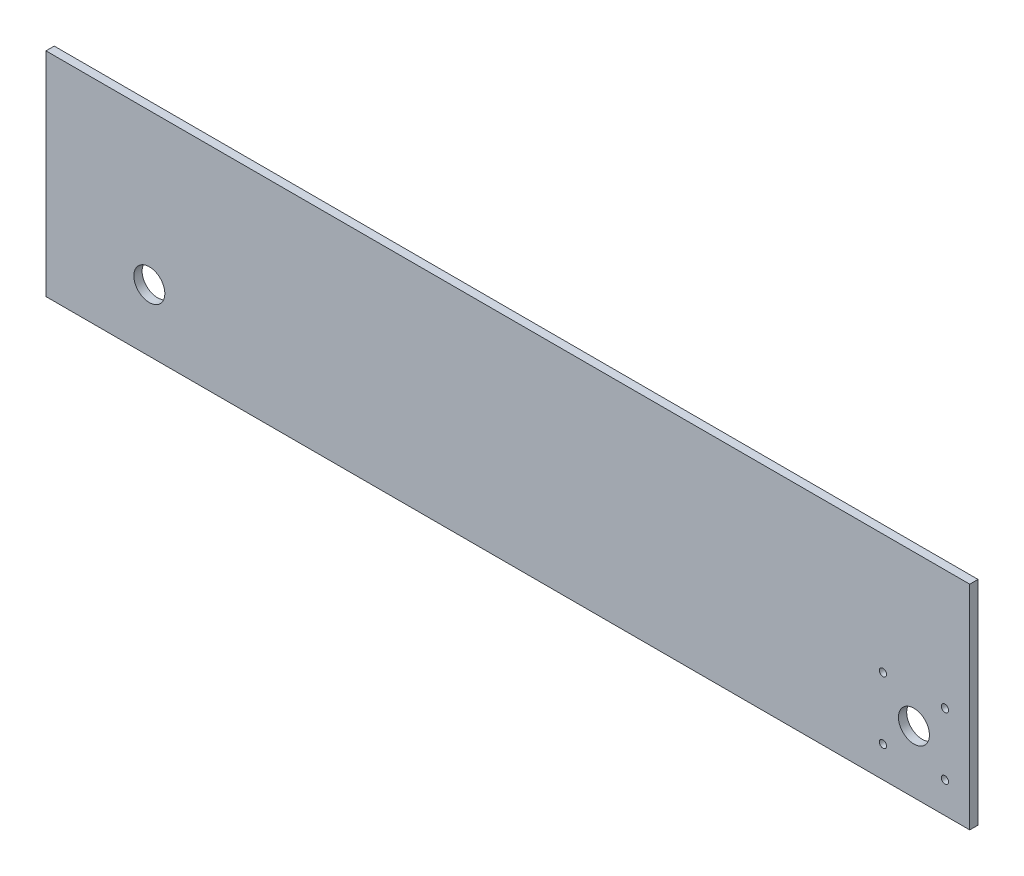
ISO-10303-21;
HEADER;
FILE_DESCRIPTION(('STEP AP214'),'2;1');
FILE_NAME('part.step','',(''),(''),'','','');
FILE_SCHEMA(('AUTOMOTIVE_DESIGN { 1 0 10303 214 1 1 1 1 }'));
ENDSEC;
DATA;
#1=APPLICATION_CONTEXT('core data for automotive mechanical design processes');
#2=APPLICATION_PROTOCOL_DEFINITION('international standard','automotive_design',2000,#1);
#3=PRODUCT_CONTEXT('',#1,'mechanical');
#4=PRODUCT('Part','Part','',(#3));
#5=PRODUCT_RELATED_PRODUCT_CATEGORY('part','',(#4));
#6=PRODUCT_DEFINITION_FORMATION('','',#4);
#7=PRODUCT_DEFINITION_CONTEXT('part definition',#1,'design');
#8=PRODUCT_DEFINITION('design','',#6,#7);
#9=PRODUCT_DEFINITION_SHAPE('','',#8);
#10=(LENGTH_UNIT() NAMED_UNIT(*) SI_UNIT(.MILLI.,.METRE.));
#11=(NAMED_UNIT(*) PLANE_ANGLE_UNIT() SI_UNIT($,.RADIAN.));
#12=(NAMED_UNIT(*) SI_UNIT($,.STERADIAN.) SOLID_ANGLE_UNIT());
#13=UNCERTAINTY_MEASURE_WITH_UNIT(LENGTH_MEASURE(1.E-05),#10,'distance_accuracy_value','');
#14=(GEOMETRIC_REPRESENTATION_CONTEXT(3) GLOBAL_UNCERTAINTY_ASSIGNED_CONTEXT((#13)) GLOBAL_UNIT_ASSIGNED_CONTEXT((#10,
#11,#12)) REPRESENTATION_CONTEXT('',''));
#15=CARTESIAN_POINT('',(0.,0.,0.));
#16=DIRECTION('',(0.,0.,1.));
#17=DIRECTION('',(1.,0.,0.));
#18=AXIS2_PLACEMENT_3D('',#15,#16,#17);
#19=CARTESIAN_POINT('',(0.,0.,4.));
#20=DIRECTION('',(1.,0.,0.));
#21=DIRECTION('',(0.,0.,-1.));
#22=AXIS2_PLACEMENT_3D('',#19,#20,#21);
#23=PLANE('',#22);
#24=DIRECTION('',(0.,-1.,0.));
#25=VECTOR('',#24,1.);
#26=CARTESIAN_POINT('',(0.,0.,0.));
#27=LINE('',#26,#25);
#28=CARTESIAN_POINT('',(0.,103.,0.));
#29=VERTEX_POINT('',#28);
#30=CARTESIAN_POINT('',(0.,0.,0.));
#31=VERTEX_POINT('',#30);
#32=EDGE_CURVE('E85',#29,#31,#27,.T.);
#33=ORIENTED_EDGE('',*,*,#32,.T.);
#34=DIRECTION('',(0.,0.,-1.));
#35=VECTOR('',#34,1.);
#36=CARTESIAN_POINT('',(0.,0.,4.));
#37=LINE('',#36,#35);
#38=CARTESIAN_POINT('',(0.,0.,4.));
#39=VERTEX_POINT('',#38);
#40=EDGE_CURVE('E11',#39,#31,#37,.T.);
#41=ORIENTED_EDGE('',*,*,#40,.F.);
#42=DIRECTION('',(0.,-1.,0.));
#43=VECTOR('',#42,1.);
#44=CARTESIAN_POINT('',(0.,0.,4.));
#45=LINE('',#44,#43);
#46=CARTESIAN_POINT('',(0.,103.,4.));
#47=VERTEX_POINT('',#46);
#48=EDGE_CURVE('E79',#47,#39,#45,.T.);
#49=ORIENTED_EDGE('',*,*,#48,.F.);
#50=DIRECTION('',(0.,0.,-1.));
#51=VECTOR('',#50,1.);
#52=CARTESIAN_POINT('',(0.,103.,4.));
#53=LINE('',#52,#51);
#54=EDGE_CURVE('E40',#47,#29,#53,.T.);
#55=ORIENTED_EDGE('',*,*,#54,.T.);
#56=EDGE_LOOP('',(#33,#41,#49,#55));
#57=FACE_BOUND('',#56,.T.);
#58=ADVANCED_FACE('F33',(#57),#23,.F.);
#59=CARTESIAN_POINT('',(0.,0.,4.));
#60=DIRECTION('',(0.,1.,0.));
#61=DIRECTION('',(0.,0.,1.));
#62=AXIS2_PLACEMENT_3D('',#59,#60,#61);
#63=PLANE('',#62);
#64=DIRECTION('',(1.,0.,0.));
#65=VECTOR('',#64,1.);
#66=CARTESIAN_POINT('',(0.,0.,0.));
#67=LINE('',#66,#65);
#68=CARTESIAN_POINT('',(447.,0.,0.));
#69=VERTEX_POINT('',#68);
#70=EDGE_CURVE('E80',#31,#69,#67,.T.);
#71=ORIENTED_EDGE('',*,*,#70,.T.);
#72=DIRECTION('',(0.,0.,-1.));
#73=VECTOR('',#72,1.);
#74=CARTESIAN_POINT('',(447.,0.,10.));
#75=LINE('',#74,#73);
#76=CARTESIAN_POINT('',(447.,0.,4.));
#77=VERTEX_POINT('',#76);
#78=EDGE_CURVE('E47',#77,#69,#75,.T.);
#79=ORIENTED_EDGE('',*,*,#78,.F.);
#80=DIRECTION('',(1.,0.,0.));
#81=VECTOR('',#80,1.);
#82=CARTESIAN_POINT('',(0.,0.,4.));
#83=LINE('',#82,#81);
#84=EDGE_CURVE('E97',#39,#77,#83,.T.);
#85=ORIENTED_EDGE('',*,*,#84,.F.);
#86=ORIENTED_EDGE('',*,*,#40,.T.);
#87=EDGE_LOOP('',(#71,#79,#85,#86));
#88=FACE_BOUND('',#87,.T.);
#89=ADVANCED_FACE('F142',(#88),#63,.F.);
#90=CARTESIAN_POINT('',(0.,103.,4.));
#91=DIRECTION('',(0.,-1.,0.));
#92=DIRECTION('',(0.,0.,-1.));
#93=AXIS2_PLACEMENT_3D('',#90,#91,#92);
#94=PLANE('',#93);
#95=DIRECTION('',(-1.,0.,0.));
#96=VECTOR('',#95,1.);
#97=CARTESIAN_POINT('',(0.,103.,4.));
#98=LINE('',#97,#96);
#99=CARTESIAN_POINT('',(447.,103.,4.));
#100=VERTEX_POINT('',#99);
#101=EDGE_CURVE('E56',#100,#47,#98,.T.);
#102=ORIENTED_EDGE('',*,*,#101,.F.);
#103=DIRECTION('',(0.,0.,-1.));
#104=VECTOR('',#103,1.);
#105=CARTESIAN_POINT('',(447.,103.,10.));
#106=LINE('',#105,#104);
#107=CARTESIAN_POINT('',(447.,103.,0.));
#108=VERTEX_POINT('',#107);
#109=EDGE_CURVE('E76',#100,#108,#106,.T.);
#110=ORIENTED_EDGE('',*,*,#109,.T.);
#111=DIRECTION('',(-1.,0.,0.));
#112=VECTOR('',#111,1.);
#113=CARTESIAN_POINT('',(0.,103.,0.));
#114=LINE('',#113,#112);
#115=EDGE_CURVE('E70',#108,#29,#114,.T.);
#116=ORIENTED_EDGE('',*,*,#115,.T.);
#117=ORIENTED_EDGE('',*,*,#54,.F.);
#118=EDGE_LOOP('',(#102,#110,#116,#117));
#119=FACE_BOUND('',#118,.T.);
#120=ADVANCED_FACE('F72',(#119),#94,.F.);
#121=CARTESIAN_POINT('',(0.,0.,4.));
#122=DIRECTION('',(0.,0.,-1.));
#123=DIRECTION('',(-1.,0.,0.));
#124=AXIS2_PLACEMENT_3D('',#121,#122,#123);
#125=PLANE('',#124);
#126=CARTESIAN_POINT('',(405.,45.,4.));
#127=DIRECTION('',(0.,0.,1.));
#128=DIRECTION('',(-1.,0.,0.));
#129=AXIS2_PLACEMENT_3D('',#126,#127,#128);
#130=CIRCLE('',#129,1.74999999999998);
#131=CARTESIAN_POINT('',(403.25,45.,4.));
#132=VERTEX_POINT('',#131);
#133=EDGE_CURVE('E129',#132,#132,#130,.T.);
#134=ORIENTED_EDGE('',*,*,#133,.F.);
#135=EDGE_LOOP('',(#134));
#136=FACE_BOUND('',#135,.T.);
#137=CARTESIAN_POINT('',(405.,15.,4.));
#138=DIRECTION('',(0.,0.,1.));
#139=DIRECTION('',(1.,0.,0.));
#140=AXIS2_PLACEMENT_3D('',#137,#138,#139);
#141=CIRCLE('',#140,1.74999999999998);
#142=CARTESIAN_POINT('',(406.75,15.,4.));
#143=VERTEX_POINT('',#142);
#144=EDGE_CURVE('E123',#143,#143,#141,.T.);
#145=ORIENTED_EDGE('',*,*,#144,.F.);
#146=EDGE_LOOP('',(#145));
#147=FACE_BOUND('',#146,.T.);
#148=CARTESIAN_POINT('',(435.,15.,4.));
#149=DIRECTION('',(0.,0.,1.));
#150=DIRECTION('',(-1.,0.,0.));
#151=AXIS2_PLACEMENT_3D('',#148,#149,#150);
#152=CIRCLE('',#151,1.74999999999998);
#153=CARTESIAN_POINT('',(433.25,15.,4.));
#154=VERTEX_POINT('',#153);
#155=EDGE_CURVE('E116',#154,#154,#152,.T.);
#156=ORIENTED_EDGE('',*,*,#155,.F.);
#157=EDGE_LOOP('',(#156));
#158=FACE_BOUND('',#157,.T.);
#159=CARTESIAN_POINT('',(435.,45.,4.));
#160=DIRECTION('',(0.,0.,1.));
#161=DIRECTION('',(1.,0.,0.));
#162=AXIS2_PLACEMENT_3D('',#159,#160,#161);
#163=CIRCLE('',#162,1.74999999999998);
#164=CARTESIAN_POINT('',(436.75,45.,4.));
#165=VERTEX_POINT('',#164);
#166=EDGE_CURVE('E110',#165,#165,#163,.T.);
#167=ORIENTED_EDGE('',*,*,#166,.F.);
#168=EDGE_LOOP('',(#167));
#169=FACE_BOUND('',#168,.T.);
#170=CARTESIAN_POINT('',(420.,30.,4.));
#171=DIRECTION('',(0.,0.,1.));
#172=DIRECTION('',(1.,0.,0.));
#173=AXIS2_PLACEMENT_3D('',#170,#171,#172);
#174=CIRCLE('',#173,7.50000000000001);
#175=CARTESIAN_POINT('',(427.5,30.,4.));
#176=VERTEX_POINT('',#175);
#177=EDGE_CURVE('E104',#176,#176,#174,.T.);
#178=ORIENTED_EDGE('',*,*,#177,.F.);
#179=EDGE_LOOP('',(#178));
#180=FACE_BOUND('',#179,.T.);
#181=CARTESIAN_POINT('',(50.,30.,4.));
#182=DIRECTION('',(0.,0.,1.));
#183=DIRECTION('',(1.,0.,0.));
#184=AXIS2_PLACEMENT_3D('',#181,#182,#183);
#185=CIRCLE('',#184,7.5);
#186=CARTESIAN_POINT('',(57.5,30.,4.));
#187=VERTEX_POINT('',#186);
#188=EDGE_CURVE('E93',#187,#187,#185,.T.);
#189=ORIENTED_EDGE('',*,*,#188,.F.);
#190=EDGE_LOOP('',(#189));
#191=FACE_BOUND('',#190,.T.);
#192=ORIENTED_EDGE('',*,*,#84,.T.);
#193=DIRECTION('',(0.,1.,0.));
#194=VECTOR('',#193,1.);
#195=CARTESIAN_POINT('',(447.,0.,4.));
#196=LINE('',#195,#194);
#197=EDGE_CURVE('E120',#77,#100,#196,.T.);
#198=ORIENTED_EDGE('',*,*,#197,.T.);
#199=ORIENTED_EDGE('',*,*,#101,.T.);
#200=ORIENTED_EDGE('',*,*,#48,.T.);
#201=EDGE_LOOP('',(#192,#198,#199,#200));
#202=FACE_BOUND('',#201,.T.);
#203=ADVANCED_FACE('F143',(#136,#147,#158,#169,#180,#191,#202),#125,.F.);
#204=CARTESIAN_POINT('',(0.,0.,0.));
#205=DIRECTION('',(0.,0.,-1.));
#206=DIRECTION('',(-1.,0.,0.));
#207=AXIS2_PLACEMENT_3D('',#204,#205,#206);
#208=PLANE('',#207);
#209=DIRECTION('',(0.,1.,0.));
#210=VECTOR('',#209,1.);
#211=CARTESIAN_POINT('',(447.,103.,0.));
#212=LINE('',#211,#210);
#213=EDGE_CURVE('E136',#69,#108,#212,.T.);
#214=ORIENTED_EDGE('',*,*,#213,.F.);
#215=ORIENTED_EDGE('',*,*,#70,.F.);
#216=ORIENTED_EDGE('',*,*,#32,.F.);
#217=ORIENTED_EDGE('',*,*,#115,.F.);
#218=EDGE_LOOP('',(#214,#215,#216,#217));
#219=FACE_BOUND('',#218,.T.);
#220=CARTESIAN_POINT('',(405.,45.,0.));
#221=DIRECTION('',(0.,0.,1.));
#222=DIRECTION('',(-1.,0.,0.));
#223=AXIS2_PLACEMENT_3D('',#220,#221,#222);
#224=CIRCLE('',#223,1.74999999999998);
#225=CARTESIAN_POINT('',(403.25,45.,0.));
#226=VERTEX_POINT('',#225);
#227=EDGE_CURVE('E113',#226,#226,#224,.T.);
#228=ORIENTED_EDGE('',*,*,#227,.T.);
#229=EDGE_LOOP('',(#228));
#230=FACE_BOUND('',#229,.T.);
#231=CARTESIAN_POINT('',(405.,15.,0.));
#232=DIRECTION('',(0.,0.,1.));
#233=DIRECTION('',(1.,0.,0.));
#234=AXIS2_PLACEMENT_3D('',#231,#232,#233);
#235=CIRCLE('',#234,1.74999999999998);
#236=CARTESIAN_POINT('',(406.75,15.,0.));
#237=VERTEX_POINT('',#236);
#238=EDGE_CURVE('E126',#237,#237,#235,.T.);
#239=ORIENTED_EDGE('',*,*,#238,.T.);
#240=EDGE_LOOP('',(#239));
#241=FACE_BOUND('',#240,.T.);
#242=CARTESIAN_POINT('',(435.,15.,0.));
#243=DIRECTION('',(0.,0.,1.));
#244=DIRECTION('',(-1.,0.,0.));
#245=AXIS2_PLACEMENT_3D('',#242,#243,#244);
#246=CIRCLE('',#245,1.74999999999998);
#247=CARTESIAN_POINT('',(433.25,15.,0.));
#248=VERTEX_POINT('',#247);
#249=EDGE_CURVE('E119',#248,#248,#246,.T.);
#250=ORIENTED_EDGE('',*,*,#249,.T.);
#251=EDGE_LOOP('',(#250));
#252=FACE_BOUND('',#251,.T.);
#253=CARTESIAN_POINT('',(435.,45.,0.));
#254=DIRECTION('',(0.,0.,1.));
#255=DIRECTION('',(1.,0.,0.));
#256=AXIS2_PLACEMENT_3D('',#253,#254,#255);
#257=CIRCLE('',#256,1.74999999999998);
#258=CARTESIAN_POINT('',(436.75,45.,0.));
#259=VERTEX_POINT('',#258);
#260=EDGE_CURVE('E107',#259,#259,#257,.T.);
#261=ORIENTED_EDGE('',*,*,#260,.T.);
#262=EDGE_LOOP('',(#261));
#263=FACE_BOUND('',#262,.T.);
#264=CARTESIAN_POINT('',(420.,30.,0.));
#265=DIRECTION('',(0.,0.,1.));
#266=DIRECTION('',(1.,0.,0.));
#267=AXIS2_PLACEMENT_3D('',#264,#265,#266);
#268=CIRCLE('',#267,7.50000000000001);
#269=CARTESIAN_POINT('',(427.5,30.,0.));
#270=VERTEX_POINT('',#269);
#271=EDGE_CURVE('E102',#270,#270,#268,.T.);
#272=ORIENTED_EDGE('',*,*,#271,.T.);
#273=EDGE_LOOP('',(#272));
#274=FACE_BOUND('',#273,.T.);
#275=CARTESIAN_POINT('',(50.,30.,0.));
#276=DIRECTION('',(0.,0.,1.));
#277=DIRECTION('',(1.,0.,0.));
#278=AXIS2_PLACEMENT_3D('',#275,#276,#277);
#279=CIRCLE('',#278,7.5);
#280=CARTESIAN_POINT('',(57.5,30.,0.));
#281=VERTEX_POINT('',#280);
#282=EDGE_CURVE('E89',#281,#281,#279,.T.);
#283=ORIENTED_EDGE('',*,*,#282,.T.);
#284=EDGE_LOOP('',(#283));
#285=FACE_BOUND('',#284,.T.);
#286=ADVANCED_FACE('F86',(#219,#230,#241,#252,#263,#274,#285),#208,.T.);
#287=CARTESIAN_POINT('',(50.,30.,0.));
#288=DIRECTION('',(0.,0.,1.));
#289=DIRECTION('',(1.,0.,0.));
#290=AXIS2_PLACEMENT_3D('',#287,#288,#289);
#291=CYLINDRICAL_SURFACE('',#290,7.5);
#292=ORIENTED_EDGE('',*,*,#282,.F.);
#293=EDGE_LOOP('',(#292));
#294=FACE_BOUND('',#293,.T.);
#295=ORIENTED_EDGE('',*,*,#188,.T.);
#296=EDGE_LOOP('',(#295));
#297=FACE_BOUND('',#296,.T.);
#298=ADVANCED_FACE('F151',(#294,#297),#291,.F.);
#299=CARTESIAN_POINT('',(420.,30.,0.));
#300=DIRECTION('',(0.,0.,1.));
#301=DIRECTION('',(1.,0.,0.));
#302=AXIS2_PLACEMENT_3D('',#299,#300,#301);
#303=CYLINDRICAL_SURFACE('',#302,7.50000000000001);
#304=ORIENTED_EDGE('',*,*,#271,.F.);
#305=EDGE_LOOP('',(#304));
#306=FACE_BOUND('',#305,.T.);
#307=ORIENTED_EDGE('',*,*,#177,.T.);
#308=EDGE_LOOP('',(#307));
#309=FACE_BOUND('',#308,.T.);
#310=ADVANCED_FACE('F220',(#306,#309),#303,.F.);
#311=CARTESIAN_POINT('',(435.,45.,0.));
#312=DIRECTION('',(0.,0.,1.));
#313=DIRECTION('',(1.,0.,0.));
#314=AXIS2_PLACEMENT_3D('',#311,#312,#313);
#315=CYLINDRICAL_SURFACE('',#314,1.74999999999998);
#316=ORIENTED_EDGE('',*,*,#260,.F.);
#317=EDGE_LOOP('',(#316));
#318=FACE_BOUND('',#317,.T.);
#319=ORIENTED_EDGE('',*,*,#166,.T.);
#320=EDGE_LOOP('',(#319));
#321=FACE_BOUND('',#320,.T.);
#322=ADVANCED_FACE('F212',(#318,#321),#315,.F.);
#323=CARTESIAN_POINT('',(435.,15.,0.));
#324=DIRECTION('',(0.,0.,1.));
#325=DIRECTION('',(1.,0.,0.));
#326=AXIS2_PLACEMENT_3D('',#323,#324,#325);
#327=CYLINDRICAL_SURFACE('',#326,1.74999999999998);
#328=ORIENTED_EDGE('',*,*,#249,.F.);
#329=EDGE_LOOP('',(#328));
#330=FACE_BOUND('',#329,.T.);
#331=ORIENTED_EDGE('',*,*,#155,.T.);
#332=EDGE_LOOP('',(#331));
#333=FACE_BOUND('',#332,.T.);
#334=ADVANCED_FACE('F204',(#330,#333),#327,.F.);
#335=CARTESIAN_POINT('',(405.,15.,0.));
#336=DIRECTION('',(0.,0.,1.));
#337=DIRECTION('',(1.,0.,0.));
#338=AXIS2_PLACEMENT_3D('',#335,#336,#337);
#339=CYLINDRICAL_SURFACE('',#338,1.74999999999998);
#340=ORIENTED_EDGE('',*,*,#238,.F.);
#341=EDGE_LOOP('',(#340));
#342=FACE_BOUND('',#341,.T.);
#343=ORIENTED_EDGE('',*,*,#144,.T.);
#344=EDGE_LOOP('',(#343));
#345=FACE_BOUND('',#344,.T.);
#346=ADVANCED_FACE('F197',(#342,#345),#339,.F.);
#347=CARTESIAN_POINT('',(405.,45.,0.));
#348=DIRECTION('',(0.,0.,1.));
#349=DIRECTION('',(1.,0.,0.));
#350=AXIS2_PLACEMENT_3D('',#347,#348,#349);
#351=CYLINDRICAL_SURFACE('',#350,1.74999999999998);
#352=ORIENTED_EDGE('',*,*,#227,.F.);
#353=EDGE_LOOP('',(#352));
#354=FACE_BOUND('',#353,.T.);
#355=ORIENTED_EDGE('',*,*,#133,.T.);
#356=EDGE_LOOP('',(#355));
#357=FACE_BOUND('',#356,.T.);
#358=ADVANCED_FACE('F188',(#354,#357),#351,.F.);
#359=CARTESIAN_POINT('',(447.,103.,10.));
#360=DIRECTION('',(-1.,0.,0.));
#361=DIRECTION('',(0.,0.,1.));
#362=AXIS2_PLACEMENT_3D('',#359,#360,#361);
#363=PLANE('',#362);
#364=ORIENTED_EDGE('',*,*,#78,.T.);
#365=ORIENTED_EDGE('',*,*,#213,.T.);
#366=ORIENTED_EDGE('',*,*,#109,.F.);
#367=ORIENTED_EDGE('',*,*,#197,.F.);
#368=EDGE_LOOP('',(#364,#365,#366,#367));
#369=FACE_BOUND('',#368,.T.);
#370=ADVANCED_FACE('F138',(#369),#363,.F.);
#371=CLOSED_SHELL('',(#58,#89,#120,#203,#286,#298,#310,#322,#334,#346,#358,#370));
#372=MANIFOLD_SOLID_BREP('B2',#371);
#373=ADVANCED_BREP_SHAPE_REPRESENTATION('',(#18,#372),#14);
#374=SHAPE_DEFINITION_REPRESENTATION(#9,#373);
ENDSEC;
END-ISO-10303-21;
